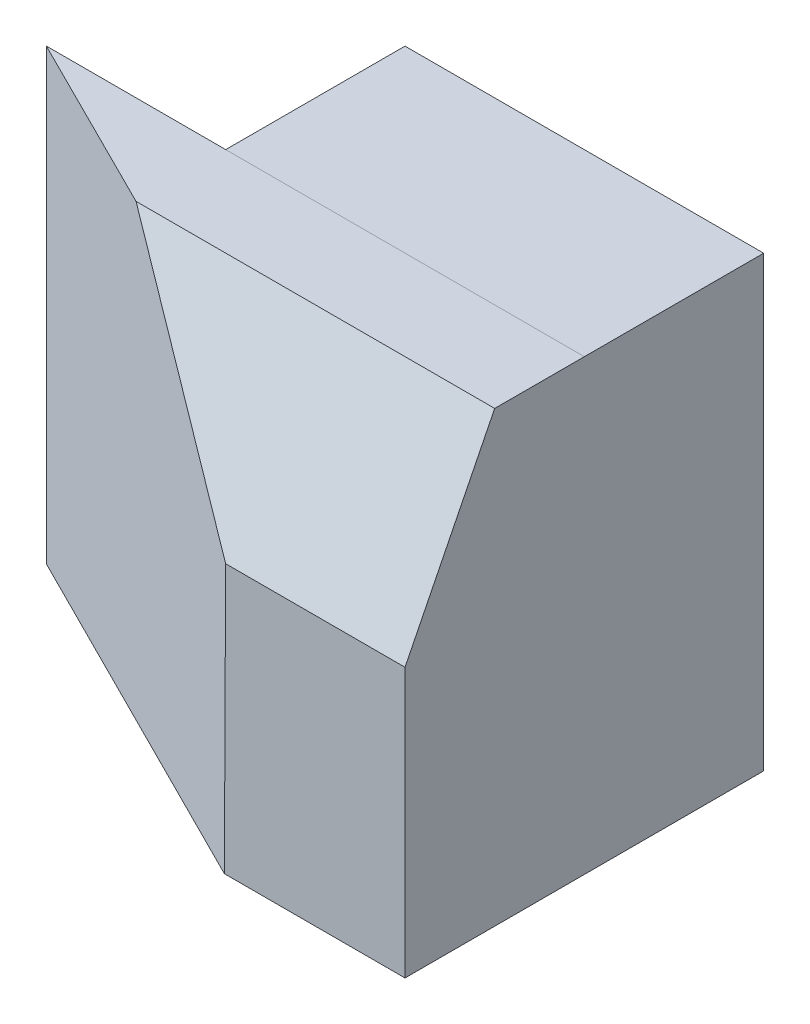
ISO-10303-21;
HEADER;
FILE_DESCRIPTION(('STEP AP214'),'2;1');
FILE_NAME('part.step','',(''),(''),'','','');
FILE_SCHEMA(('AUTOMOTIVE_DESIGN { 1 0 10303 214 1 1 1 1 }'));
ENDSEC;
DATA;
#1=APPLICATION_CONTEXT('core data for automotive mechanical design processes');
#2=APPLICATION_PROTOCOL_DEFINITION('international standard','automotive_design',2000,#1);
#3=PRODUCT_CONTEXT('',#1,'mechanical');
#4=PRODUCT('Part','Part','',(#3));
#5=PRODUCT_RELATED_PRODUCT_CATEGORY('part','',(#4));
#6=PRODUCT_DEFINITION_FORMATION('','',#4);
#7=PRODUCT_DEFINITION_CONTEXT('part definition',#1,'design');
#8=PRODUCT_DEFINITION('design','',#6,#7);
#9=PRODUCT_DEFINITION_SHAPE('','',#8);
#10=(LENGTH_UNIT() NAMED_UNIT(*) SI_UNIT(.MILLI.,.METRE.));
#11=(NAMED_UNIT(*) PLANE_ANGLE_UNIT() SI_UNIT($,.RADIAN.));
#12=(NAMED_UNIT(*) SI_UNIT($,.STERADIAN.) SOLID_ANGLE_UNIT());
#13=UNCERTAINTY_MEASURE_WITH_UNIT(LENGTH_MEASURE(1.E-05),#10,'distance_accuracy_value','');
#14=(GEOMETRIC_REPRESENTATION_CONTEXT(3) GLOBAL_UNCERTAINTY_ASSIGNED_CONTEXT((#13)) GLOBAL_UNIT_ASSIGNED_CONTEXT((#10,
#11,#12)) REPRESENTATION_CONTEXT('',''));
#15=CARTESIAN_POINT('',(0.,0.,0.));
#16=DIRECTION('',(0.,0.,1.));
#17=DIRECTION('',(1.,0.,0.));
#18=AXIS2_PLACEMENT_3D('',#15,#16,#17);
#19=CARTESIAN_POINT('',(0.,0.,2.));
#20=DIRECTION('',(1.,0.,0.));
#21=DIRECTION('',(0.,0.,-1.));
#22=AXIS2_PLACEMENT_3D('',#19,#20,#21);
#23=PLANE('',#22);
#24=CARTESIAN_POINT('',(5.61912164131476E-05,3.00012773643859,1.99988775768125));
#25=CARTESIAN_POINT('',(4.36326253842613E-05,2.8751224312558,1.99991284354817));
#26=CARTESIAN_POINT('',(3.08649674798056E-05,2.7501171261794,1.99993834702754));
#27=CARTESIAN_POINT('',(5.28464134836565E-06,2.50010651610141,1.99998944389468));
#28=CARTESIAN_POINT('',(-7.5280268786E-06,2.37510121109982,2.00001503728245));
#29=CARTESIAN_POINT('',(-3.28252502744629E-05,2.1250906005643,2.00006556865004));
#30=CARTESIAN_POINT('',(-4.53098054424014E-05,2.00008529503037,2.00009050662985));
#31=CARTESIAN_POINT('',(-6.9655529127358E-05,1.75007468294104,2.00013913737061));
#32=CARTESIAN_POINT('',(-8.15166976408036E-05,1.62506937638563,2.00016283013154));
#33=CARTESIAN_POINT('',(-0.000104410437751115,1.37505876192083,2.0002085605257));
#34=CARTESIAN_POINT('',(-0.000115443009341526,1.25005345401143,2.00023059815892));
#35=CARTESIAN_POINT('',(-0.000136599881973369,1.00004283671014,2.00027285914904));
#36=CARTESIAN_POINT('',(-0.000146724183006821,0.875037527318254,2.00029308250593));
#37=CARTESIAN_POINT('',(-0.000166117953802448,0.625026907166375,2.00033182168871));
#38=CARTESIAN_POINT('',(-0.000175387423557509,0.500021596406383,2.00035033751459));
#39=CARTESIAN_POINT('',(-0.000193353495823487,0.250010973934434,2.00038622486031));
#40=CARTESIAN_POINT('',(-0.000202050098330987,0.125005662222476,2.00040359638015));
#41=CARTESIAN_POINT('',(-0.000210601249222971,3.50467987576068E-07,2.00042067735944));
#42=B_SPLINE_CURVE_WITH_KNOTS('',3,(#24,#25,#26,#27,#28,#29,#30,#31,#32,#33,#34,#35,#36,#37,#38,
#39,#40,#41),.UNSPECIFIED.,.F.,.F.,(4,2,2,2,2,2,2,2,4),(0.,0.375015924990164,0.750031849824546,
1.12504777575473,1.50006370383399,1.87507963483484,2.25009556913078,2.62511150654722,
3.00012744620007),.UNSPECIFIED.);
#43=CARTESIAN_POINT('',(0.000140254495708435,3.00014025449571,2.));
#44=VERTEX_POINT('',#43);
#45=CARTESIAN_POINT('',(0.,0.,2.00026315241134));
#46=VERTEX_POINT('',#45);
#47=EDGE_CURVE('E109',#44,#46,#42,.T.);
#48=ORIENTED_EDGE('',*,*,#47,.F.);
#49=DIRECTION('',(0.,0.,-1.));
#50=VECTOR('',#49,1.);
#51=CARTESIAN_POINT('',(0.,3.,2.));
#52=LINE('',#51,#50);
#53=CARTESIAN_POINT('',(0.,3.,0.));
#54=VERTEX_POINT('',#53);
#55=EDGE_CURVE('E179',#44,#54,#52,.T.);
#56=ORIENTED_EDGE('',*,*,#55,.T.);
#57=DIRECTION('',(0.,-1.,0.));
#58=VECTOR('',#57,1.);
#59=CARTESIAN_POINT('',(0.,0.,0.));
#60=LINE('',#59,#58);
#61=CARTESIAN_POINT('',(0.,0.,0.));
#62=VERTEX_POINT('',#61);
#63=EDGE_CURVE('E135',#54,#62,#60,.T.);
#64=ORIENTED_EDGE('',*,*,#63,.T.);
#65=DIRECTION('',(0.,0.,-1.));
#66=VECTOR('',#65,1.);
#67=CARTESIAN_POINT('',(0.,0.,2.));
#68=LINE('',#67,#66);
#69=EDGE_CURVE('E191',#46,#62,#68,.T.);
#70=ORIENTED_EDGE('',*,*,#69,.F.);
#71=EDGE_LOOP('',(#48,#56,#64,#70));
#72=FACE_BOUND('',#71,.T.);
#73=ADVANCED_FACE('F37',(#72),#23,.F.);
#74=CARTESIAN_POINT('',(0.,0.,2.));
#75=DIRECTION('',(0.,1.,0.));
#76=DIRECTION('',(0.,0.,1.));
#77=AXIS2_PLACEMENT_3D('',#74,#75,#76);
#78=PLANE('',#77);
#79=CARTESIAN_POINT('',(-0.000210601249258659,3.49967988655492E-07,2.00042067735951));
#80=CARTESIAN_POINT('',(0.165854163412155,3.14395296423206E-07,2.0837112496992));
#81=CARTESIAN_POINT('',(0.331920561534457,2.76112088611609E-07,2.16699856505351));
#82=CARTESIAN_POINT('',(0.66405522543546,1.9644208303407E-07,2.33356946510636));
#83=CARTESIAN_POINT('',(0.83012349121413,1.55055285318017E-07,2.41685304980497));
#84=CARTESIAN_POINT('',(1.16226049603316,7.149553996101E-08,2.58341927430417));
#85=CARTESIAN_POINT('',(1.32832923507352,2.93225923222732E-08,2.66670191410476));
#86=CARTESIAN_POINT('',(1.66046495525002,-5.21020588864298E-08,2.83327070518405));
#87=CARTESIAN_POINT('',(1.82653193638615,-9.13537624129974E-08,2.91655685646279));
#88=CARTESIAN_POINT('',(2.15866203050627,-1.63429380509391E-07,3.0831368854719));
#89=CARTESIAN_POINT('',(2.32472514349014,-1.96253294863142E-07,3.16643076320252));
#90=CARTESIAN_POINT('',(2.656846054037,-2.53068527070801E-07,3.33302913574227));
#91=CARTESIAN_POINT('',(2.82290385159973,-2.77059844489452E-07,3.41633363055193));
#92=CARTESIAN_POINT('',(3.15501374136705,-3.15562870969293E-07,3.58295401469421));
#93=CARTESIAN_POINT('',(3.32106583357135,-3.30074579511045E-07,3.66626990402746));
#94=CARTESIAN_POINT('',(3.65316636687416,-3.53030748088774E-07,3.83290897580139));
#95=CARTESIAN_POINT('',(3.81921480797253,-3.61475207881285E-07,3.91623215824237));
#96=CARTESIAN_POINT('',(3.98526244853074,-3.68592223894972E-07,3.99955693546779));
#97=B_SPLINE_CURVE_WITH_KNOTS('',3,(#79,#80,#81,#82,#83,#84,#85,#86,#87,#88,#89,#90,#91,#92,#93,
#94,#95,#96),.UNSPECIFIED.,.F.,.F.,(4,2,2,2,2,2,2,2,4),(0.,0.557344982355296,1.11468995575178,
1.67203492757727,2.22937990768276,2.78672490652389,3.34406993283018,3.90141498967625,
4.45876006888734),.UNSPECIFIED.);
#98=CARTESIAN_POINT('',(3.98559301498437,0.,4.));
#99=VERTEX_POINT('',#98);
#100=EDGE_CURVE('E105',#99,#46,#97,.F.);
#101=ORIENTED_EDGE('',*,*,#100,.T.);
#102=ORIENTED_EDGE('',*,*,#69,.T.);
#103=DIRECTION('',(1.,0.,0.));
#104=VECTOR('',#103,1.);
#105=CARTESIAN_POINT('',(0.,0.,0.));
#106=LINE('',#105,#104);
#107=CARTESIAN_POINT('',(6.,0.,0.));
#108=VERTEX_POINT('',#107);
#109=EDGE_CURVE('E267',#62,#108,#106,.T.);
#110=ORIENTED_EDGE('',*,*,#109,.T.);
#111=DIRECTION('',(0.,0.,-1.));
#112=VECTOR('',#111,1.);
#113=CARTESIAN_POINT('',(6.,0.,2.));
#114=LINE('',#113,#112);
#115=CARTESIAN_POINT('',(6.,0.,4.));
#116=VERTEX_POINT('',#115);
#117=EDGE_CURVE('E131',#116,#108,#114,.T.);
#118=ORIENTED_EDGE('',*,*,#117,.F.);
#119=DIRECTION('',(1.,0.,0.));
#120=VECTOR('',#119,1.);
#121=CARTESIAN_POINT('',(6.,0.,4.));
#122=LINE('',#121,#120);
#123=EDGE_CURVE('E122',#99,#116,#122,.T.);
#124=ORIENTED_EDGE('',*,*,#123,.F.);
#125=EDGE_LOOP('',(#101,#102,#110,#118,#124));
#126=FACE_BOUND('',#125,.T.);
#127=ADVANCED_FACE('F129',(#126),#78,.F.);
#128=CARTESIAN_POINT('',(6.,5.00106876189932,4.));
#129=DIRECTION('',(0.,-1.,0.));
#130=DIRECTION('',(0.,0.,-1.));
#131=AXIS2_PLACEMENT_3D('',#128,#129,#130);
#132=PLANE('',#131);
#133=CARTESIAN_POINT('',(2.0001950117308,5.00106843783731,2.99961046280457));
#134=CARTESIAN_POINT('',(1.91685644589322,5.0010684465344,2.95795425101049));
#135=CARTESIAN_POINT('',(1.83351885987188,5.00106845360126,2.91629607901379));
#136=CARTESIAN_POINT('',(1.66684546040845,5.0010684647894,2.83297619428185));
#137=CARTESIAN_POINT('',(1.58350964696632,5.00106846891066,2.79131448154669));
#138=CARTESIAN_POINT('',(1.41683960320202,5.00106847452245,2.70798789380202));
#139=CARTESIAN_POINT('',(1.33350537287982,5.00106847601297,2.66632301879256));
#140=CARTESIAN_POINT('',(1.16683829279702,5.00106847669987,2.58299051110856));
#141=CARTESIAN_POINT('',(1.0835054430364,5.00106847589624,2.54132287843405));
#142=CARTESIAN_POINT('',(0.916840922100498,5.00106847233049,2.4579852588708));
#143=CARTESIAN_POINT('',(0.833509250925202,5.00106846956835,2.41631527198208));
#144=CARTESIAN_POINT('',(0.666846893180015,5.00106846240792,2.33297333146468));
#145=CARTESIAN_POINT('',(0.583516206610115,5.00106845800962,2.29130137783601));
#146=CARTESIAN_POINT('',(0.416855637736756,5.00106844787653,2.20795586407222));
#147=CARTESIAN_POINT('',(0.333525755433292,5.00106844214175,2.16628230393711));
#148=CARTESIAN_POINT('',(0.1668666473547,5.0010684295812,2.08293387224729));
#149=CARTESIAN_POINT('',(0.083537421579568,5.00106842275543,2.04125900069258));
#150=CARTESIAN_POINT('',(0.000208450008024432,5.00106841550691,1.9995836208757));
#151=B_SPLINE_CURVE_WITH_KNOTS('',3,(#133,#134,#135,#136,#137,#138,#139,#140,#141,#142,#143,
#144,#145,#146,#147,#148,#149,#150),.UNSPECIFIED.,.F.,.F.,(4,2,2,2,2,2,2,2,4),(0.,
0.27950851293204,0.559017018966305,0.838525519274495,1.11803401491051,1.39754250679638,
1.67705099571743,1.95655948232284,2.23606796712795),.UNSPECIFIED.);
#152=CARTESIAN_POINT('',(2.00048716540205,5.00106876189932,3.));
#153=VERTEX_POINT('',#152);
#154=CARTESIAN_POINT('',(0.,5.00106876189932,2.));
#155=VERTEX_POINT('',#154);
#156=EDGE_CURVE('E417',#153,#155,#151,.T.);
#157=ORIENTED_EDGE('',*,*,#156,.F.);
#158=DIRECTION('',(1.,0.,0.));
#159=VECTOR('',#158,1.);
#160=CARTESIAN_POINT('',(6.,5.00106876189932,3.));
#161=LINE('',#160,#159);
#162=CARTESIAN_POINT('',(6.,5.00106876189932,3.));
#163=VERTEX_POINT('',#162);
#164=EDGE_CURVE('E49',#153,#163,#161,.T.);
#165=ORIENTED_EDGE('',*,*,#164,.T.);
#166=DIRECTION('',(0.,0.,-1.));
#167=VECTOR('',#166,1.);
#168=CARTESIAN_POINT('',(6.,5.00106876189932,4.));
#169=LINE('',#168,#167);
#170=CARTESIAN_POINT('',(6.,5.00053438094966,2.));
#171=VERTEX_POINT('',#170);
#172=EDGE_CURVE('E133',#163,#171,#169,.T.);
#173=ORIENTED_EDGE('',*,*,#172,.T.);
#174=CARTESIAN_POINT('',(6.,5.00106876189932,2.));
#175=DIRECTION('',(-1.,0.,0.));
#176=VECTOR('',#175,1.);
#177=LINE('',#174,#176);
#178=CARTESIAN_POINT('',(2.00038668168776,5.00077336337552,2.));
#179=VERTEX_POINT('',#178);
#180=EDGE_CURVE('E150',#171,#179,#177,.T.);
#181=ORIENTED_EDGE('',*,*,#180,.T.);
#182=CARTESIAN_POINT('',(2.00053438094966,5.00106876189932,2.));
#183=DIRECTION('',(-1.,0.,0.));
#184=VECTOR('',#183,1.);
#185=LINE('',#182,#184);
#186=EDGE_CURVE('E246',#179,#155,#185,.T.);
#187=ORIENTED_EDGE('',*,*,#186,.T.);
#188=EDGE_LOOP('',(#157,#165,#173,#181,#187));
#189=FACE_BOUND('',#188,.T.);
#190=ADVANCED_FACE('F159',(#189),#132,.F.);
#191=CARTESIAN_POINT('',(0.,0.,4.));
#192=DIRECTION('',(0.,0.,1.));
#193=DIRECTION('',(1.,0.,0.));
#194=AXIS2_PLACEMENT_3D('',#191,#192,#193);
#195=PLANE('',#194);
#196=DIRECTION('',(-1.,0.,0.));
#197=VECTOR('',#196,1.);
#198=CARTESIAN_POINT('',(0.,3.00106876189932,4.));
#199=LINE('',#198,#197);
#200=CARTESIAN_POINT('',(6.,3.00106876189932,4.));
#201=VERTEX_POINT('',#200);
#202=CARTESIAN_POINT('',(3.99952151756816,3.00106876189932,4.));
#203=VERTEX_POINT('',#202);
#204=EDGE_CURVE('E125',#201,#203,#199,.T.);
#205=ORIENTED_EDGE('',*,*,#204,.T.);
#206=CARTESIAN_POINT('',(3.98526244853074,-3.68592223894972E-07,3.99955693546779));
#207=CARTESIAN_POINT('',(3.98588237879808,0.125044169009144,3.9995636798729));
#208=CARTESIAN_POINT('',(3.98650261623638,0.250088705149377,3.99956981069255));
#209=CARTESIAN_POINT('',(3.98774235639344,0.500177778650769,3.9995835399389));
#210=CARTESIAN_POINT('',(3.98836185911221,0.625222316011927,3.99959113836556));
#211=CARTESIAN_POINT('',(3.98959878075888,0.87531139406744,3.99961049760338));
#212=CARTESIAN_POINT('',(3.99021619968689,1.00035593476179,3.99962225841432));
#213=CARTESIAN_POINT('',(3.99144722163682,1.25044502256959,3.99965340233407));
#214=CARTESIAN_POINT('',(3.99206082465909,1.37548956968303,3.99967278544219));
#215=CARTESIAN_POINT('',(3.99328236878505,1.62557867353031,3.99972286137959));
#216=CARTESIAN_POINT('',(3.99389030988946,1.75062323026414,3.99975355420745));
#217=CARTESIAN_POINT('',(3.99509867712451,2.00071235651842,3.99982995107488));
#218=CARTESIAN_POINT('',(3.99569910325631,2.12575692603887,3.99987565511215));
#219=CARTESIAN_POINT('',(3.99689068886876,2.37584608097986,3.99998557338739));
#220=CARTESIAN_POINT('',(3.99748184835092,2.50089066640039,4.00004978762234));
#221=CARTESIAN_POINT('',(3.99865351941003,2.75097985493567,4.00019948535186));
#222=CARTESIAN_POINT('',(3.99923403098862,2.87602445805043,4.00028496884314));
#223=CARTESIAN_POINT('',(3.99980852803019,3.00106908007911,4.00038246649991));
#224=B_SPLINE_CURVE_WITH_KNOTS('',3,(#206,#207,#208,#209,#210,#211,#212,#213,#214,#215,#216,
#217,#218,#219,#220,#221,#222,#223),.UNSPECIFIED.,.F.,.F.,(4,2,2,2,2,2,2,2,4),(0.,
0.375138223494743,0.750276439987385,1.12541463638298,1.50055279826585,1.87569091240241,
2.25082896922867,2.62596696490191,3.00110490248912),.UNSPECIFIED.);
#225=EDGE_CURVE('E57',#203,#99,#224,.F.);
#226=ORIENTED_EDGE('',*,*,#225,.T.);
#227=ORIENTED_EDGE('',*,*,#123,.T.);
#228=DIRECTION('',(0.,1.,0.));
#229=VECTOR('',#228,1.);
#230=CARTESIAN_POINT('',(6.,0.,4.));
#231=LINE('',#230,#229);
#232=EDGE_CURVE('E134',#116,#201,#231,.T.);
#233=ORIENTED_EDGE('',*,*,#232,.T.);
#234=EDGE_LOOP('',(#205,#226,#227,#233));
#235=FACE_BOUND('',#234,.T.);
#236=ADVANCED_FACE('F120',(#235),#195,.T.);
#237=CARTESIAN_POINT('',(0.,3.00106876189932,4.));
#238=DIRECTION('',(0.,0.447213595499958,0.894427190999916));
#239=DIRECTION('',(1.,0.,0.));
#240=AXIS2_PLACEMENT_3D('',#237,#238,#239);
#241=PLANE('',#240);
#242=ORIENTED_EDGE('',*,*,#164,.F.);
#243=CARTESIAN_POINT('',(3.99980852803019,3.0010690800791,4.00038246649991));
#244=CARTESIAN_POINT('',(3.91651359198796,3.08440235155934,3.95863909610768));
#245=CARTESIAN_POINT('',(3.83321354258882,3.1677356296358,3.91690594443449));
#246=CARTESIAN_POINT('',(3.66660529137227,3.33440219933605,3.83345592559642));
#247=CARTESIAN_POINT('',(3.58329708955446,3.41773549095984,3.79173905843233));
#248=CARTESIAN_POINT('',(3.41667461176624,3.58440208413726,3.70831745767338));
#249=CARTESIAN_POINT('',(3.33336033579553,3.66773538569089,3.66661272407914));
#250=CARTESIAN_POINT('',(3.16672735770346,3.83440199613449,3.5832120982024));
#251=CARTESIAN_POINT('',(3.0834086555819,3.91773530502446,3.5415162059203));
#252=CARTESIAN_POINT('',(2.91676811760604,4.08440192801675,3.45813068099539));
#253=CARTESIAN_POINT('',(2.83344628175163,4.16773524211907,3.41644104835281));
#254=CARTESIAN_POINT('',(2.6668004132002,4.33440187399967,3.33306617121161));
#255=CARTESIAN_POINT('',(2.58347638050311,4.41773519177796,3.29138092671312));
#256=CARTESIAN_POINT('',(2.41682677783316,4.5844018299292,3.20801350833414));
#257=CARTESIAN_POINT('',(2.33350120786026,4.66773515030215,3.16633133445373));
#258=CARTESIAN_POINT('',(2.16684889658424,4.83440179299452,3.08296932643261));
#259=CARTESIAN_POINT('',(2.0835221552811,4.91773511531394,3.04128949229195));
#260=CARTESIAN_POINT('',(2.0001950117308,5.00106843783731,2.99961046280457));
#261=B_SPLINE_CURVE_WITH_KNOTS('',3,(#243,#244,#245,#246,#247,#248,#249,#250,#251,#252,#253,
#254,#255,#256,#257,#258,#259,#260),.UNSPECIFIED.,.F.,.F.,(4,2,2,2,2,2,2,2,4),(0.,
0.374999872095835,0.749999762759694,1.12499967268383,1.49999959952001,1.87499953986316,
2.24999949042496,2.62499944857665,2.99999941252659),.UNSPECIFIED.);
#262=EDGE_CURVE('E126',#153,#203,#261,.F.);
#263=ORIENTED_EDGE('',*,*,#262,.T.);
#264=ORIENTED_EDGE('',*,*,#204,.F.);
#265=DIRECTION('',(0.,-0.894427190999916,0.447213595499958));
#266=VECTOR('',#265,1.);
#267=CARTESIAN_POINT('',(6.,3.00106876189932,4.));
#268=LINE('',#267,#266);
#269=EDGE_CURVE('E13',#163,#201,#268,.T.);
#270=ORIENTED_EDGE('',*,*,#269,.F.);
#271=EDGE_LOOP('',(#242,#263,#264,#270));
#272=FACE_BOUND('',#271,.T.);
#273=ADVANCED_FACE('F39',(#272),#241,.T.);
#274=CARTESIAN_POINT('',(6.,0.,2.));
#275=DIRECTION('',(-1.,0.,0.));
#276=DIRECTION('',(0.,0.,1.));
#277=AXIS2_PLACEMENT_3D('',#274,#275,#276);
#278=PLANE('',#277);
#279=ORIENTED_EDGE('',*,*,#172,.F.);
#280=ORIENTED_EDGE('',*,*,#269,.T.);
#281=ORIENTED_EDGE('',*,*,#232,.F.);
#282=ORIENTED_EDGE('',*,*,#117,.T.);
#283=DIRECTION('',(0.,1.,0.));
#284=VECTOR('',#283,1.);
#285=CARTESIAN_POINT('',(6.,0.,0.));
#286=LINE('',#285,#284);
#287=CARTESIAN_POINT('',(6.,5.,0.));
#288=VERTEX_POINT('',#287);
#289=EDGE_CURVE('E269',#108,#288,#286,.T.);
#290=ORIENTED_EDGE('',*,*,#289,.T.);
#291=DIRECTION('',(0.,0.,-1.));
#292=VECTOR('',#291,1.);
#293=CARTESIAN_POINT('',(6.,5.,2.));
#294=LINE('',#293,#292);
#295=EDGE_CURVE('E205',#171,#288,#294,.T.);
#296=ORIENTED_EDGE('',*,*,#295,.F.);
#297=EDGE_LOOP('',(#279,#280,#281,#282,#290,#296));
#298=FACE_BOUND('',#297,.T.);
#299=ADVANCED_FACE('F217',(#298),#278,.F.);
#300=CARTESIAN_POINT('',(2.,5.,2.));
#301=DIRECTION('',(0.,-1.,0.));
#302=DIRECTION('',(0.,0.,-1.));
#303=AXIS2_PLACEMENT_3D('',#300,#301,#302);
#304=PLANE('',#303);
#305=DIRECTION('',(-1.,0.,0.));
#306=VECTOR('',#305,1.);
#307=CARTESIAN_POINT('',(2.,5.,0.));
#308=LINE('',#307,#306);
#309=CARTESIAN_POINT('',(2.,5.,0.));
#310=VERTEX_POINT('',#309);
#311=EDGE_CURVE('E271',#288,#310,#308,.T.);
#312=ORIENTED_EDGE('',*,*,#311,.T.);
#313=DIRECTION('',(0.,0.,-1.));
#314=VECTOR('',#313,1.);
#315=CARTESIAN_POINT('',(2.,5.,2.));
#316=LINE('',#315,#314);
#317=EDGE_CURVE('E187',#179,#310,#316,.T.);
#318=ORIENTED_EDGE('',*,*,#317,.F.);
#319=ORIENTED_EDGE('',*,*,#180,.F.);
#320=ORIENTED_EDGE('',*,*,#295,.T.);
#321=EDGE_LOOP('',(#312,#318,#319,#320));
#322=FACE_BOUND('',#321,.T.);
#323=ADVANCED_FACE('F207',(#322),#304,.F.);
#324=CARTESIAN_POINT('',(0.,3.,2.));
#325=DIRECTION('',(0.707106781186547,-0.707106781186547,0.));
#326=DIRECTION('',(0.707106781186548,0.707106781186548,0.));
#327=AXIS2_PLACEMENT_3D('',#324,#325,#326);
#328=PLANE('',#327);
#329=DIRECTION('',(-0.707106781186548,-0.707106781186548,0.));
#330=VECTOR('',#329,1.);
#331=CARTESIAN_POINT('',(0.,3.,0.));
#332=LINE('',#331,#330);
#333=EDGE_CURVE('E272',#310,#54,#332,.T.);
#334=ORIENTED_EDGE('',*,*,#333,.T.);
#335=ORIENTED_EDGE('',*,*,#55,.F.);
#336=DIRECTION('',(-0.707106781186548,-0.707106781186548,0.));
#337=VECTOR('',#336,1.);
#338=CARTESIAN_POINT('',(0.,3.,2.));
#339=LINE('',#338,#337);
#340=EDGE_CURVE('E188',#179,#44,#339,.T.);
#341=ORIENTED_EDGE('',*,*,#340,.F.);
#342=ORIENTED_EDGE('',*,*,#317,.T.);
#343=EDGE_LOOP('',(#334,#335,#341,#342));
#344=FACE_BOUND('',#343,.T.);
#345=ADVANCED_FACE('F216',(#344),#328,.F.);
#346=CARTESIAN_POINT('',(0.,0.,0.));
#347=DIRECTION('',(0.,0.,-1.));
#348=DIRECTION('',(-1.,0.,0.));
#349=AXIS2_PLACEMENT_3D('',#346,#347,#348);
#350=PLANE('',#349);
#351=ORIENTED_EDGE('',*,*,#63,.F.);
#352=ORIENTED_EDGE('',*,*,#333,.F.);
#353=ORIENTED_EDGE('',*,*,#311,.F.);
#354=ORIENTED_EDGE('',*,*,#289,.F.);
#355=ORIENTED_EDGE('',*,*,#109,.F.);
#356=EDGE_LOOP('',(#351,#352,#353,#354,#355));
#357=FACE_BOUND('',#356,.T.);
#358=ADVANCED_FACE('F171',(#357),#350,.T.);
#359=CARTESIAN_POINT('',(0.,0.,2.));
#360=DIRECTION('',(0.,0.,1.));
#361=DIRECTION('',(1.,0.,0.));
#362=AXIS2_PLACEMENT_3D('',#359,#360,#361);
#363=PLANE('',#362);
#364=ORIENTED_EDGE('',*,*,#186,.F.);
#365=ORIENTED_EDGE('',*,*,#340,.T.);
#366=CARTESIAN_POINT('',(0.000208449560832797,5.00106841550691,1.99958362065204));
#367=CARTESIAN_POINT('',(0.000205181068453347,4.91769588278494,1.99959014948674));
#368=CARTESIAN_POINT('',(0.000201429500561648,4.83432335016087,1.99959764326791));
#369=CARTESIAN_POINT('',(0.000193018042978379,4.66757828642215,1.99961444520891));
#370=CARTESIAN_POINT('',(0.000188358153300767,4.58420575530749,1.99962375336873));
#371=CARTESIAN_POINT('',(0.000178187881336378,4.41746069448793,1.99964406855285));
#372=CARTESIAN_POINT('',(0.000172677499061325,4.33408816478302,1.99965507557714));
#373=CARTESIAN_POINT('',(0.000160889395363734,4.1673431066473,1.99967862239063));
#374=CARTESIAN_POINT('',(0.000154611673950418,4.08397057821648,1.99969116217982));
#375=CARTESIAN_POINT('',(0.000141385966725969,3.91722552246816,1.99971758061567));
#376=CARTESIAN_POINT('',(0.000134437980921643,3.83385299515066,1.99973145926231));
#377=CARTESIAN_POINT('',(0.000119981219756747,3.66710794144771,1.99976033673638));
#378=CARTESIAN_POINT('',(0.000112472444400806,3.58373541506227,1.99977533556379));
#379=CARTESIAN_POINT('',(9.7011702292259E-05,3.41699036302876,1.9998062184963));
#380=CARTESIAN_POINT('',(8.90597355424746E-05,3.3336178373807,1.99982210260139));
#381=CARTESIAN_POINT('',(7.28352400886283E-05,3.16687278661728,1.99985451113615));
#382=CARTESIAN_POINT('',(6.45627113860176E-05,3.08350026150192,1.99987103556581));
#383=CARTESIAN_POINT('',(5.61912164131476E-05,3.00012773643859,1.99988775768125));
#384=B_SPLINE_CURVE_WITH_KNOTS('',3,(#366,#367,#368,#369,#370,#371,#372,#373,#374,#375,#376,
#377,#378,#379,#380,#381,#382,#383),.UNSPECIFIED.,.F.,.F.,(4,2,2,2,2,2,2,2,4),(0.,
0.250117599113126,0.500235194382388,0.750352786203679,1.00047037501871,1.25058796129394,
1.50070554550443,1.75082312812207,2.00094070960739),.UNSPECIFIED.);
#385=EDGE_CURVE('E137',#155,#44,#384,.T.);
#386=ORIENTED_EDGE('',*,*,#385,.F.);
#387=EDGE_LOOP('',(#364,#365,#386));
#388=FACE_BOUND('',#387,.T.);
#389=ADVANCED_FACE('F168',(#388),#363,.F.);
#390=CARTESIAN_POINT('',(4.0330658377977,-0.0568005391306866,4.02368544027924));
#391=CARTESIAN_POINT('',(3.21712709398097,-0.0554336468204618,3.61420237359252));
#392=CARTESIAN_POINT('',(2.40119392541091,-0.0540667637749392,3.20470817031447));
#393=CARTESIAN_POINT('',(1.58510380277212,-0.0526996199099773,2.79552748380535));
#394=CARTESIAN_POINT('',(0.769050821766176,-0.0513325377653641,2.38627260664402));
#395=CARTESIAN_POINT('',(-0.0469789799580643,-0.0499654941390723,1.97697142871736));
#396=CARTESIAN_POINT('',(4.03544278890162,0.964097013336118,4.02235368524576));
#397=CARTESIAN_POINT('',(3.21923694095492,0.965464349508359,3.61340416078876));
#398=CARTESIAN_POINT('',(2.40303995729171,0.96683167095032,3.20443692986809));
#399=CARTESIAN_POINT('',(1.58681911367317,0.968199032041715,2.79551735936272));
#400=CARTESIAN_POINT('',(0.770619749976534,0.969566357438712,2.38655488257422));
#401=CARTESIAN_POINT('',(-0.0455500036280259,0.970933633630946,1.97753325943501));
#402=CARTESIAN_POINT('',(4.03783069735063,1.98499454759448,4.02100004284448));
#403=CARTESIAN_POINT('',(3.22133491548237,1.98636236556629,3.61262966327379));
#404=CARTESIAN_POINT('',(2.40486389312,1.98773014239384,3.20420982642971));
#405=CARTESIAN_POINT('',(1.58851310083092,1.98909771942828,2.79554982923546));
#406=CARTESIAN_POINT('',(0.772189870376269,1.99046525066166,2.38683477709842));
#407=CARTESIAN_POINT('',(-0.04411835548001,1.99183275696105,1.97808975317894));
#408=CARTESIAN_POINT('',(4.04014300556322,3.00589220748203,4.01979741240515));
#409=CARTESIAN_POINT('',(3.22332773452354,3.00726055636704,3.61206521452379));
#410=CARTESIAN_POINT('',(2.40665691438207,3.00862866520983,3.20404447503759));
#411=CARTESIAN_POINT('',(1.59019610313959,3.00999642506898,2.7956042414154));
#412=CARTESIAN_POINT('',(0.773763724822981,3.01136413767953,2.3871072128396));
#413=CARTESIAN_POINT('',(-0.0426063402030595,3.01273174674057,1.97848571306226));
#414=CARTESIAN_POINT('',(4.04179024165131,4.02679097255748,4.01992326784234));
#415=CARTESIAN_POINT('',(3.22503351962421,4.02815922414829,3.61207411792912));
#416=CARTESIAN_POINT('',(2.40833250525569,4.02952738316654,3.20411369160705));
#417=CARTESIAN_POINT('',(1.59177556702186,4.03089530276534,2.7958654722727));
#418=CARTESIAN_POINT('',(0.775299308251075,4.03226308829451,2.38745609518835));
#419=CARTESIAN_POINT('',(-0.041145176607867,4.03363082102319,1.97898324950928));
#420=CARTESIAN_POINT('',(4.04331830791353,5.04768993566416,4.02028716577863));
#421=CARTESIAN_POINT('',(3.2265492467564,5.0490582077596,3.61246266335756));
#422=CARTESIAN_POINT('',(2.40984925041906,5.05042636508613,3.2045002035116));
#423=CARTESIAN_POINT('',(1.59328568968051,5.05179429568992,2.79626521267334));
#424=CARTESIAN_POINT('',(0.776761582244486,5.05316216073192,2.38795141360773));
#425=CARTESIAN_POINT('',(-0.0397427224216864,5.05452999286655,1.97959805838107));
#426=B_SPLINE_SURFACE_WITH_KNOTS('',5,5,((#390,#391,#392,#393,#394,#395),(#396,#397,#398,#399,
#400,#401),(#402,#403,#404,#405,#406,#407),(#408,#409,#410,#411,#412,#413),(#414,#415,#416,#417,
#418,#419),(#420,#421,#422,#423,#424,#425)),.UNSPECIFIED.,.F.,.F.,.F.,(6,6),(6,6),
(-2.65402719091377,2.45047327349308),(-2.28289195240523,2.28173694571272),.UNSPECIFIED.);
#427=ORIENTED_EDGE('',*,*,#262,.F.);
#428=ORIENTED_EDGE('',*,*,#156,.T.);
#429=ORIENTED_EDGE('',*,*,#385,.T.);
#430=ORIENTED_EDGE('',*,*,#47,.T.);
#431=ORIENTED_EDGE('',*,*,#100,.F.);
#432=ORIENTED_EDGE('',*,*,#225,.F.);
#433=EDGE_LOOP('',(#427,#428,#429,#430,#431,#432));
#434=FACE_BOUND('',#433,.T.);
#435=ADVANCED_FACE('F107',(#434),#426,.T.);
#436=CLOSED_SHELL('',(#73,#127,#190,#236,#273,#299,#323,#345,#358,#389,#435));
#437=MANIFOLD_SOLID_BREP('B2',#436);
#438=ADVANCED_BREP_SHAPE_REPRESENTATION('',(#18,#437),#14);
#439=SHAPE_DEFINITION_REPRESENTATION(#9,#438);
ENDSEC;
END-ISO-10303-21;
